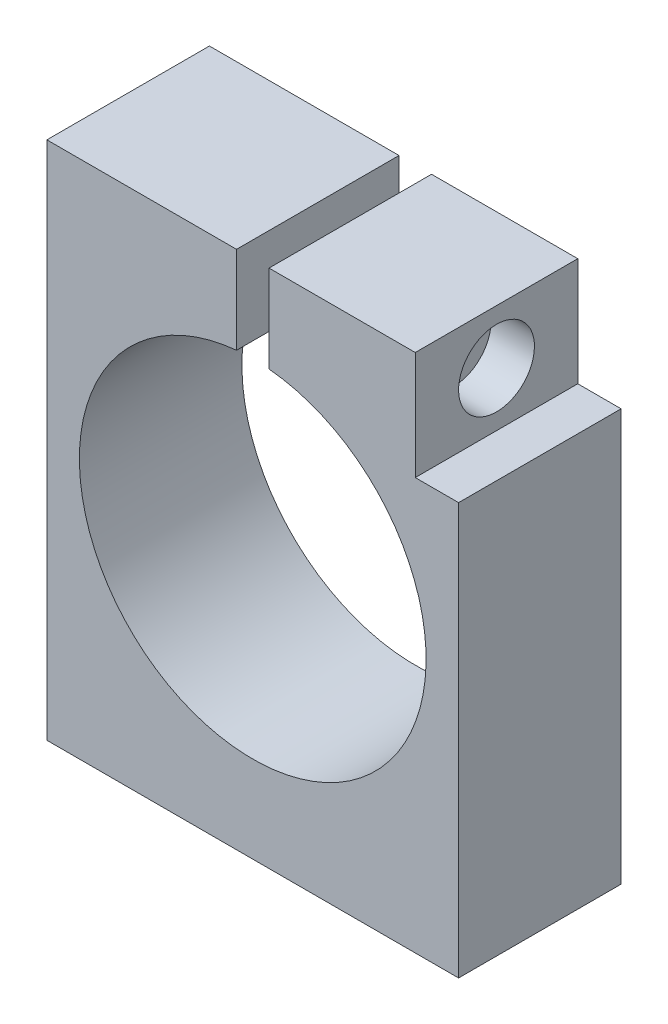
ISO-10303-21;
HEADER;
FILE_DESCRIPTION(('STEP AP214'),'2;1');
FILE_NAME('part.step','',(''),(''),'','','');
FILE_SCHEMA(('AUTOMOTIVE_DESIGN { 1 0 10303 214 1 1 1 1 }'));
ENDSEC;
DATA;
#1=APPLICATION_CONTEXT('core data for automotive mechanical design processes');
#2=APPLICATION_PROTOCOL_DEFINITION('international standard','automotive_design',2000,#1);
#3=PRODUCT_CONTEXT('',#1,'mechanical');
#4=PRODUCT('Part','Part','',(#3));
#5=PRODUCT_RELATED_PRODUCT_CATEGORY('part','',(#4));
#6=PRODUCT_DEFINITION_FORMATION('','',#4);
#7=PRODUCT_DEFINITION_CONTEXT('part definition',#1,'design');
#8=PRODUCT_DEFINITION('design','',#6,#7);
#9=PRODUCT_DEFINITION_SHAPE('','',#8);
#10=(LENGTH_UNIT() NAMED_UNIT(*) SI_UNIT(.MILLI.,.METRE.));
#11=(NAMED_UNIT(*) PLANE_ANGLE_UNIT() SI_UNIT($,.RADIAN.));
#12=(NAMED_UNIT(*) SI_UNIT($,.STERADIAN.) SOLID_ANGLE_UNIT());
#13=UNCERTAINTY_MEASURE_WITH_UNIT(LENGTH_MEASURE(1.E-05),#10,'distance_accuracy_value','');
#14=(GEOMETRIC_REPRESENTATION_CONTEXT(3) GLOBAL_UNCERTAINTY_ASSIGNED_CONTEXT((#13)) GLOBAL_UNIT_ASSIGNED_CONTEXT((#10,
#11,#12)) REPRESENTATION_CONTEXT('',''));
#15=CARTESIAN_POINT('',(0.,0.,0.));
#16=DIRECTION('',(0.,0.,1.));
#17=DIRECTION('',(1.,0.,0.));
#18=AXIS2_PLACEMENT_3D('',#15,#16,#17);
#19=CARTESIAN_POINT('',(-6.85746695095947,-4.99999999999999,15.));
#20=DIRECTION('',(0.,0.,-1.));
#21=DIRECTION('',(-1.,0.,0.));
#22=AXIS2_PLACEMENT_3D('',#19,#20,#21);
#23=CYLINDRICAL_SURFACE('',#22,16.);
#24=CARTESIAN_POINT('',(-6.85746695095947,-4.99999999999999,0.));
#25=DIRECTION('',(0.,0.,1.));
#26=DIRECTION('',(1.,0.,0.));
#27=AXIS2_PLACEMENT_3D('',#24,#25,#26);
#28=CIRCLE('',#27,16.);
#29=CARTESIAN_POINT('',(-8.35433092899201,10.9298273132909,0.));
#30=VERTEX_POINT('',#29);
#31=CARTESIAN_POINT('',(-5.35433092899201,10.929236707999,0.));
#32=VERTEX_POINT('',#31);
#33=EDGE_CURVE('E160',#30,#32,#28,.T.);
#34=ORIENTED_EDGE('',*,*,#33,.F.);
#35=DIRECTION('',(0.,0.,-1.));
#36=VECTOR('',#35,1.);
#37=CARTESIAN_POINT('',(-8.35433092899201,10.9298273132909,15.));
#38=LINE('',#37,#36);
#39=CARTESIAN_POINT('',(-8.35433092899201,10.9298273132909,15.));
#40=VERTEX_POINT('',#39);
#41=EDGE_CURVE('E11',#40,#30,#38,.T.);
#42=ORIENTED_EDGE('',*,*,#41,.F.);
#43=CARTESIAN_POINT('',(-6.85746695095947,-4.99999999999999,15.));
#44=DIRECTION('',(0.,0.,1.));
#45=DIRECTION('',(1.,0.,0.));
#46=AXIS2_PLACEMENT_3D('',#43,#44,#45);
#47=CIRCLE('',#46,16.);
#48=CARTESIAN_POINT('',(-5.35433092899201,10.929236707999,15.));
#49=VERTEX_POINT('',#48);
#50=EDGE_CURVE('E147',#40,#49,#47,.T.);
#51=ORIENTED_EDGE('',*,*,#50,.T.);
#52=DIRECTION('',(0.,0.,-1.));
#53=VECTOR('',#52,1.);
#54=CARTESIAN_POINT('',(-5.35433092899201,10.929236707999,15.));
#55=LINE('',#54,#53);
#56=EDGE_CURVE('E90',#49,#32,#55,.T.);
#57=ORIENTED_EDGE('',*,*,#56,.T.);
#58=EDGE_LOOP('',(#34,#42,#51,#57));
#59=FACE_BOUND('',#58,.T.);
#60=ADVANCED_FACE('F34',(#59),#23,.F.);
#61=CARTESIAN_POINT('',(-8.35433092899201,0.,15.));
#62=DIRECTION('',(1.,0.,0.));
#63=DIRECTION('',(0.,1.,0.));
#64=AXIS2_PLACEMENT_3D('',#61,#62,#63);
#65=PLANE('',#64);
#66=CARTESIAN_POINT('',(-8.35433092899201,14.,7.5));
#67=DIRECTION('',(1.,0.,0.));
#68=DIRECTION('',(0.,1.,0.));
#69=AXIS2_PLACEMENT_3D('',#66,#67,#68);
#70=CIRCLE('',#69,1.75);
#71=CARTESIAN_POINT('',(-8.35433092899201,15.75,7.5));
#72=VERTEX_POINT('',#71);
#73=EDGE_CURVE('E157',#72,#72,#70,.T.);
#74=ORIENTED_EDGE('',*,*,#73,.F.);
#75=EDGE_LOOP('',(#74));
#76=FACE_BOUND('',#75,.T.);
#77=DIRECTION('',(0.,-1.,0.));
#78=VECTOR('',#77,1.);
#79=CARTESIAN_POINT('',(-8.35433092899201,0.,0.));
#80=LINE('',#79,#78);
#81=CARTESIAN_POINT('',(-8.35433092899201,19.,0.));
#82=VERTEX_POINT('',#81);
#83=EDGE_CURVE('E198',#82,#30,#80,.T.);
#84=ORIENTED_EDGE('',*,*,#83,.F.);
#85=DIRECTION('',(0.,0.,-1.));
#86=VECTOR('',#85,1.);
#87=CARTESIAN_POINT('',(-8.35433092899201,19.,15.));
#88=LINE('',#87,#86);
#89=CARTESIAN_POINT('',(-8.35433092899201,19.,15.));
#90=VERTEX_POINT('',#89);
#91=EDGE_CURVE('E42',#90,#82,#88,.T.);
#92=ORIENTED_EDGE('',*,*,#91,.F.);
#93=DIRECTION('',(0.,-1.,0.));
#94=VECTOR('',#93,1.);
#95=CARTESIAN_POINT('',(-8.35433092899201,0.,15.));
#96=LINE('',#95,#94);
#97=EDGE_CURVE('E142',#90,#40,#96,.T.);
#98=ORIENTED_EDGE('',*,*,#97,.T.);
#99=ORIENTED_EDGE('',*,*,#41,.T.);
#100=EDGE_LOOP('',(#84,#92,#98,#99));
#101=FACE_BOUND('',#100,.T.);
#102=ADVANCED_FACE('F189',(#76,#101),#65,.T.);
#103=CARTESIAN_POINT('',(0.,19.,15.));
#104=DIRECTION('',(0.,1.,0.));
#105=DIRECTION('',(0.,0.,1.));
#106=AXIS2_PLACEMENT_3D('',#103,#104,#105);
#107=PLANE('',#106);
#108=DIRECTION('',(1.,0.,0.));
#109=VECTOR('',#108,1.);
#110=CARTESIAN_POINT('',(0.,19.,0.));
#111=LINE('',#110,#109);
#112=CARTESIAN_POINT('',(-25.8574669509595,19.,0.));
#113=VERTEX_POINT('',#112);
#114=EDGE_CURVE('E205',#113,#82,#111,.T.);
#115=ORIENTED_EDGE('',*,*,#114,.F.);
#116=DIRECTION('',(0.,0.,-1.));
#117=VECTOR('',#116,1.);
#118=CARTESIAN_POINT('',(-25.8574669509595,19.,15.));
#119=LINE('',#118,#117);
#120=CARTESIAN_POINT('',(-25.8574669509595,19.,15.));
#121=VERTEX_POINT('',#120);
#122=EDGE_CURVE('E233',#121,#113,#119,.T.);
#123=ORIENTED_EDGE('',*,*,#122,.F.);
#124=DIRECTION('',(1.,0.,0.));
#125=VECTOR('',#124,1.);
#126=CARTESIAN_POINT('',(0.,19.,15.));
#127=LINE('',#126,#125);
#128=EDGE_CURVE('E136',#121,#90,#127,.T.);
#129=ORIENTED_EDGE('',*,*,#128,.T.);
#130=ORIENTED_EDGE('',*,*,#91,.T.);
#131=EDGE_LOOP('',(#115,#123,#129,#130));
#132=FACE_BOUND('',#131,.T.);
#133=ADVANCED_FACE('F193',(#132),#107,.T.);
#134=CARTESIAN_POINT('',(-25.8574669509595,0.,15.));
#135=DIRECTION('',(1.,0.,0.));
#136=DIRECTION('',(0.,1.,0.));
#137=AXIS2_PLACEMENT_3D('',#134,#135,#136);
#138=PLANE('',#137);
#139=DIRECTION('',(0.,-1.,0.));
#140=VECTOR('',#139,1.);
#141=CARTESIAN_POINT('',(-25.8574669509595,0.,0.));
#142=LINE('',#141,#140);
#143=CARTESIAN_POINT('',(-25.8574669509595,-29.,0.));
#144=VERTEX_POINT('',#143);
#145=EDGE_CURVE('E207',#113,#144,#142,.T.);
#146=ORIENTED_EDGE('',*,*,#145,.T.);
#147=DIRECTION('',(0.,0.,-1.));
#148=VECTOR('',#147,1.);
#149=CARTESIAN_POINT('',(-25.8574669509595,-29.,15.));
#150=LINE('',#149,#148);
#151=CARTESIAN_POINT('',(-25.8574669509595,-29.,15.));
#152=VERTEX_POINT('',#151);
#153=EDGE_CURVE('E230',#152,#144,#150,.T.);
#154=ORIENTED_EDGE('',*,*,#153,.F.);
#155=DIRECTION('',(0.,-1.,0.));
#156=VECTOR('',#155,1.);
#157=CARTESIAN_POINT('',(-25.8574669509595,0.,15.));
#158=LINE('',#157,#156);
#159=EDGE_CURVE('E141',#121,#152,#158,.T.);
#160=ORIENTED_EDGE('',*,*,#159,.F.);
#161=ORIENTED_EDGE('',*,*,#122,.T.);
#162=EDGE_LOOP('',(#146,#154,#160,#161));
#163=FACE_BOUND('',#162,.T.);
#164=ADVANCED_FACE('F239',(#163),#138,.F.);
#165=CARTESIAN_POINT('',(0.,-29.,15.));
#166=DIRECTION('',(0.,1.,0.));
#167=DIRECTION('',(0.,0.,1.));
#168=AXIS2_PLACEMENT_3D('',#165,#166,#167);
#169=PLANE('',#168);
#170=DIRECTION('',(1.,0.,0.));
#171=VECTOR('',#170,1.);
#172=CARTESIAN_POINT('',(0.,-29.,0.));
#173=LINE('',#172,#171);
#174=CARTESIAN_POINT('',(12.1425330490405,-29.,0.));
#175=VERTEX_POINT('',#174);
#176=EDGE_CURVE('E212',#144,#175,#173,.T.);
#177=ORIENTED_EDGE('',*,*,#176,.T.);
#178=DIRECTION('',(0.,0.,-1.));
#179=VECTOR('',#178,1.);
#180=CARTESIAN_POINT('',(12.1425330490405,-29.,15.));
#181=LINE('',#180,#179);
#182=CARTESIAN_POINT('',(12.1425330490405,-29.,15.));
#183=VERTEX_POINT('',#182);
#184=EDGE_CURVE('E228',#183,#175,#181,.T.);
#185=ORIENTED_EDGE('',*,*,#184,.F.);
#186=DIRECTION('',(1.,0.,0.));
#187=VECTOR('',#186,1.);
#188=CARTESIAN_POINT('',(0.,-29.,15.));
#189=LINE('',#188,#187);
#190=EDGE_CURVE('E145',#152,#183,#189,.T.);
#191=ORIENTED_EDGE('',*,*,#190,.F.);
#192=ORIENTED_EDGE('',*,*,#153,.T.);
#193=EDGE_LOOP('',(#177,#185,#191,#192));
#194=FACE_BOUND('',#193,.T.);
#195=ADVANCED_FACE('F242',(#194),#169,.F.);
#196=CARTESIAN_POINT('',(12.1425330490405,0.,15.));
#197=DIRECTION('',(1.,0.,0.));
#198=DIRECTION('',(0.,1.,0.));
#199=AXIS2_PLACEMENT_3D('',#196,#197,#198);
#200=PLANE('',#199);
#201=DIRECTION('',(0.,-1.,0.));
#202=VECTOR('',#201,1.);
#203=CARTESIAN_POINT('',(12.1425330490405,0.,0.));
#204=LINE('',#203,#202);
#205=CARTESIAN_POINT('',(12.1425330490405,9.00000000000001,0.));
#206=VERTEX_POINT('',#205);
#207=EDGE_CURVE('E215',#206,#175,#204,.T.);
#208=ORIENTED_EDGE('',*,*,#207,.F.);
#209=DIRECTION('',(0.,0.,-1.));
#210=VECTOR('',#209,1.);
#211=CARTESIAN_POINT('',(12.1425330490405,9.00000000000001,15.));
#212=LINE('',#211,#210);
#213=CARTESIAN_POINT('',(12.1425330490405,9.00000000000001,15.));
#214=VERTEX_POINT('',#213);
#215=EDGE_CURVE('E226',#214,#206,#212,.T.);
#216=ORIENTED_EDGE('',*,*,#215,.F.);
#217=DIRECTION('',(0.,-1.,0.));
#218=VECTOR('',#217,1.);
#219=CARTESIAN_POINT('',(12.1425330490405,0.,15.));
#220=LINE('',#219,#218);
#221=EDGE_CURVE('E244',#214,#183,#220,.T.);
#222=ORIENTED_EDGE('',*,*,#221,.T.);
#223=ORIENTED_EDGE('',*,*,#184,.T.);
#224=EDGE_LOOP('',(#208,#216,#222,#223));
#225=FACE_BOUND('',#224,.T.);
#226=ADVANCED_FACE('F269',(#225),#200,.T.);
#227=CARTESIAN_POINT('',(0.,9.00000000000001,15.));
#228=DIRECTION('',(0.,1.,0.));
#229=DIRECTION('',(0.,0.,1.));
#230=AXIS2_PLACEMENT_3D('',#227,#228,#229);
#231=PLANE('',#230);
#232=DIRECTION('',(1.,0.,0.));
#233=VECTOR('',#232,1.);
#234=CARTESIAN_POINT('',(0.,9.00000000000001,0.));
#235=LINE('',#234,#233);
#236=CARTESIAN_POINT('',(8.14253304904053,9.00000000000001,0.));
#237=VERTEX_POINT('',#236);
#238=EDGE_CURVE('E218',#237,#206,#235,.T.);
#239=ORIENTED_EDGE('',*,*,#238,.F.);
#240=DIRECTION('',(0.,0.,-1.));
#241=VECTOR('',#240,1.);
#242=CARTESIAN_POINT('',(8.14253304904053,9.00000000000001,15.));
#243=LINE('',#242,#241);
#244=CARTESIAN_POINT('',(8.14253304904053,9.00000000000001,15.));
#245=VERTEX_POINT('',#244);
#246=EDGE_CURVE('E125',#245,#237,#243,.T.);
#247=ORIENTED_EDGE('',*,*,#246,.F.);
#248=DIRECTION('',(1.,0.,0.));
#249=VECTOR('',#248,1.);
#250=CARTESIAN_POINT('',(0.,9.00000000000001,15.));
#251=LINE('',#250,#249);
#252=EDGE_CURVE('E132',#245,#214,#251,.T.);
#253=ORIENTED_EDGE('',*,*,#252,.T.);
#254=ORIENTED_EDGE('',*,*,#215,.T.);
#255=EDGE_LOOP('',(#239,#247,#253,#254));
#256=FACE_BOUND('',#255,.T.);
#257=ADVANCED_FACE('F250',(#256),#231,.T.);
#258=CARTESIAN_POINT('',(8.14253304904053,0.,15.));
#259=DIRECTION('',(1.,0.,0.));
#260=DIRECTION('',(0.,1.,0.));
#261=AXIS2_PLACEMENT_3D('',#258,#259,#260);
#262=PLANE('',#261);
#263=CARTESIAN_POINT('',(8.14253304904053,14.,7.5));
#264=DIRECTION('',(1.,0.,0.));
#265=DIRECTION('',(0.,1.,0.));
#266=AXIS2_PLACEMENT_3D('',#263,#264,#265);
#267=CIRCLE('',#266,3.5);
#268=CARTESIAN_POINT('',(8.14253304904053,17.5,7.5));
#269=VERTEX_POINT('',#268);
#270=EDGE_CURVE('E153',#269,#269,#267,.T.);
#271=ORIENTED_EDGE('',*,*,#270,.F.);
#272=EDGE_LOOP('',(#271));
#273=FACE_BOUND('',#272,.T.);
#274=DIRECTION('',(0.,-1.,0.));
#275=VECTOR('',#274,1.);
#276=CARTESIAN_POINT('',(8.14253304904053,0.,0.));
#277=LINE('',#276,#275);
#278=CARTESIAN_POINT('',(8.14253304904053,19.,0.));
#279=VERTEX_POINT('',#278);
#280=EDGE_CURVE('E120',#279,#237,#277,.T.);
#281=ORIENTED_EDGE('',*,*,#280,.F.);
#282=DIRECTION('',(0.,0.,-1.));
#283=VECTOR('',#282,1.);
#284=CARTESIAN_POINT('',(8.14253304904053,19.,15.));
#285=LINE('',#284,#283);
#286=CARTESIAN_POINT('',(8.14253304904053,19.,15.));
#287=VERTEX_POINT('',#286);
#288=EDGE_CURVE('E115',#287,#279,#285,.T.);
#289=ORIENTED_EDGE('',*,*,#288,.F.);
#290=DIRECTION('',(0.,-1.,0.));
#291=VECTOR('',#290,1.);
#292=CARTESIAN_POINT('',(8.14253304904053,0.,15.));
#293=LINE('',#292,#291);
#294=EDGE_CURVE('E118',#287,#245,#293,.T.);
#295=ORIENTED_EDGE('',*,*,#294,.T.);
#296=ORIENTED_EDGE('',*,*,#246,.T.);
#297=EDGE_LOOP('',(#281,#289,#295,#296));
#298=FACE_BOUND('',#297,.T.);
#299=ADVANCED_FACE('F117',(#273,#298),#262,.T.);
#300=CARTESIAN_POINT('',(-5.35433092899201,19.,0.));
#301=VERTEX_POINT('',#300);
#302=EDGE_CURVE('E209',#301,#279,#111,.T.);
#303=ORIENTED_EDGE('',*,*,#302,.F.);
#304=DIRECTION('',(0.,0.,-1.));
#305=VECTOR('',#304,1.);
#306=CARTESIAN_POINT('',(-5.35433092899201,19.,15.));
#307=LINE('',#306,#305);
#308=CARTESIAN_POINT('',(-5.35433092899201,19.,15.));
#309=VERTEX_POINT('',#308);
#310=EDGE_CURVE('E83',#309,#301,#307,.T.);
#311=ORIENTED_EDGE('',*,*,#310,.F.);
#312=EDGE_CURVE('E129',#309,#287,#127,.T.);
#313=ORIENTED_EDGE('',*,*,#312,.T.);
#314=ORIENTED_EDGE('',*,*,#288,.T.);
#315=EDGE_LOOP('',(#303,#311,#313,#314));
#316=FACE_BOUND('',#315,.T.);
#317=ADVANCED_FACE('F134',(#316),#107,.T.);
#318=CARTESIAN_POINT('',(-5.35433092899201,0.,15.));
#319=DIRECTION('',(1.,0.,0.));
#320=DIRECTION('',(0.,0.,-1.));
#321=AXIS2_PLACEMENT_3D('',#318,#319,#320);
#322=PLANE('',#321);
#323=CARTESIAN_POINT('',(-5.35433092899201,14.,7.5));
#324=DIRECTION('',(1.,0.,0.));
#325=DIRECTION('',(0.,0.,-1.));
#326=AXIS2_PLACEMENT_3D('',#323,#324,#325);
#327=CIRCLE('',#326,1.75);
#328=CARTESIAN_POINT('',(-5.35433092899201,14.,5.75));
#329=VERTEX_POINT('',#328);
#330=EDGE_CURVE('E163',#329,#329,#327,.T.);
#331=ORIENTED_EDGE('',*,*,#330,.T.);
#332=EDGE_LOOP('',(#331));
#333=FACE_BOUND('',#332,.T.);
#334=DIRECTION('',(0.,-1.,0.));
#335=VECTOR('',#334,1.);
#336=CARTESIAN_POINT('',(-5.35433092899201,0.,0.));
#337=LINE('',#336,#335);
#338=EDGE_CURVE('E150',#301,#32,#337,.T.);
#339=ORIENTED_EDGE('',*,*,#338,.T.);
#340=ORIENTED_EDGE('',*,*,#56,.F.);
#341=DIRECTION('',(0.,-1.,0.));
#342=VECTOR('',#341,1.);
#343=CARTESIAN_POINT('',(-5.35433092899201,0.,15.));
#344=LINE('',#343,#342);
#345=EDGE_CURVE('E50',#309,#49,#344,.T.);
#346=ORIENTED_EDGE('',*,*,#345,.F.);
#347=ORIENTED_EDGE('',*,*,#310,.T.);
#348=EDGE_LOOP('',(#339,#340,#346,#347));
#349=FACE_BOUND('',#348,.T.);
#350=ADVANCED_FACE('F252',(#333,#349),#322,.F.);
#351=CARTESIAN_POINT('',(0.,0.,15.));
#352=DIRECTION('',(0.,0.,1.));
#353=DIRECTION('',(1.,0.,0.));
#354=AXIS2_PLACEMENT_3D('',#351,#352,#353);
#355=PLANE('',#354);
#356=ORIENTED_EDGE('',*,*,#50,.F.);
#357=ORIENTED_EDGE('',*,*,#97,.F.);
#358=ORIENTED_EDGE('',*,*,#128,.F.);
#359=ORIENTED_EDGE('',*,*,#159,.T.);
#360=ORIENTED_EDGE('',*,*,#190,.T.);
#361=ORIENTED_EDGE('',*,*,#221,.F.);
#362=ORIENTED_EDGE('',*,*,#252,.F.);
#363=ORIENTED_EDGE('',*,*,#294,.F.);
#364=ORIENTED_EDGE('',*,*,#312,.F.);
#365=ORIENTED_EDGE('',*,*,#345,.T.);
#366=EDGE_LOOP('',(#356,#357,#358,#359,#360,#361,#362,#363,#364,#365));
#367=FACE_BOUND('',#366,.T.);
#368=ADVANCED_FACE('F128',(#367),#355,.T.);
#369=CARTESIAN_POINT('',(0.,0.,0.));
#370=DIRECTION('',(0.,0.,1.));
#371=DIRECTION('',(1.,0.,0.));
#372=AXIS2_PLACEMENT_3D('',#369,#370,#371);
#373=PLANE('',#372);
#374=ORIENTED_EDGE('',*,*,#33,.T.);
#375=ORIENTED_EDGE('',*,*,#338,.F.);
#376=ORIENTED_EDGE('',*,*,#302,.T.);
#377=ORIENTED_EDGE('',*,*,#280,.T.);
#378=ORIENTED_EDGE('',*,*,#238,.T.);
#379=ORIENTED_EDGE('',*,*,#207,.T.);
#380=ORIENTED_EDGE('',*,*,#176,.F.);
#381=ORIENTED_EDGE('',*,*,#145,.F.);
#382=ORIENTED_EDGE('',*,*,#114,.T.);
#383=ORIENTED_EDGE('',*,*,#83,.T.);
#384=EDGE_LOOP('',(#374,#375,#376,#377,#378,#379,#380,#381,#382,#383));
#385=FACE_BOUND('',#384,.T.);
#386=ADVANCED_FACE('F202',(#385),#373,.F.);
#387=CARTESIAN_POINT('',(4.14253304904054,14.,7.5));
#388=DIRECTION('',(1.,0.,0.));
#389=DIRECTION('',(0.,1.,0.));
#390=AXIS2_PLACEMENT_3D('',#387,#388,#389);
#391=CYLINDRICAL_SURFACE('',#390,3.5);
#392=CARTESIAN_POINT('',(4.14253304904054,14.,7.5));
#393=DIRECTION('',(1.,0.,0.));
#394=DIRECTION('',(0.,1.,0.));
#395=AXIS2_PLACEMENT_3D('',#392,#393,#394);
#396=CIRCLE('',#395,3.5);
#397=CARTESIAN_POINT('',(4.14253304904054,17.5,7.5));
#398=VERTEX_POINT('',#397);
#399=EDGE_CURVE('E156',#398,#398,#396,.T.);
#400=ORIENTED_EDGE('',*,*,#399,.F.);
#401=EDGE_LOOP('',(#400));
#402=FACE_BOUND('',#401,.T.);
#403=ORIENTED_EDGE('',*,*,#270,.T.);
#404=EDGE_LOOP('',(#403));
#405=FACE_BOUND('',#404,.T.);
#406=ADVANCED_FACE('F291',(#402,#405),#391,.F.);
#407=CARTESIAN_POINT('',(4.14253304904054,14.,7.5));
#408=DIRECTION('',(1.,0.,0.));
#409=DIRECTION('',(0.,1.,0.));
#410=AXIS2_PLACEMENT_3D('',#407,#408,#409);
#411=PLANE('',#410);
#412=CARTESIAN_POINT('',(4.14253304904054,14.,7.5));
#413=DIRECTION('',(1.,0.,0.));
#414=DIRECTION('',(0.,1.,0.));
#415=AXIS2_PLACEMENT_3D('',#412,#413,#414);
#416=CIRCLE('',#415,1.75);
#417=CARTESIAN_POINT('',(4.14253304904054,15.75,7.5));
#418=VERTEX_POINT('',#417);
#419=EDGE_CURVE('E167',#418,#418,#416,.T.);
#420=ORIENTED_EDGE('',*,*,#419,.F.);
#421=EDGE_LOOP('',(#420));
#422=FACE_BOUND('',#421,.T.);
#423=ORIENTED_EDGE('',*,*,#399,.T.);
#424=EDGE_LOOP('',(#423));
#425=FACE_BOUND('',#424,.T.);
#426=ADVANCED_FACE('F185',(#422,#425),#411,.T.);
#427=CARTESIAN_POINT('',(-15.8574669509595,14.,7.5));
#428=DIRECTION('',(1.,0.,0.));
#429=DIRECTION('',(0.,1.,0.));
#430=AXIS2_PLACEMENT_3D('',#427,#428,#429);
#431=CYLINDRICAL_SURFACE('',#430,1.75);
#432=ORIENTED_EDGE('',*,*,#419,.T.);
#433=EDGE_LOOP('',(#432));
#434=FACE_BOUND('',#433,.T.);
#435=ORIENTED_EDGE('',*,*,#330,.F.);
#436=EDGE_LOOP('',(#435));
#437=FACE_BOUND('',#436,.T.);
#438=ADVANCED_FACE('F177',(#434,#437),#431,.F.);
#439=ORIENTED_EDGE('',*,*,#73,.T.);
#440=EDGE_LOOP('',(#439));
#441=FACE_BOUND('',#440,.T.);
#442=CARTESIAN_POINT('',(-15.8574669509595,14.,7.5));
#443=DIRECTION('',(1.,0.,0.));
#444=DIRECTION('',(0.,1.,0.));
#445=AXIS2_PLACEMENT_3D('',#442,#443,#444);
#446=CIRCLE('',#445,1.75);
#447=CARTESIAN_POINT('',(-15.8574669509595,15.75,7.5));
#448=VERTEX_POINT('',#447);
#449=EDGE_CURVE('E166',#448,#448,#446,.T.);
#450=ORIENTED_EDGE('',*,*,#449,.F.);
#451=EDGE_LOOP('',(#450));
#452=FACE_BOUND('',#451,.T.);
#453=ADVANCED_FACE('F175',(#441,#452),#431,.F.);
#454=CARTESIAN_POINT('',(-15.8574669509595,14.,7.5));
#455=DIRECTION('',(1.,0.,0.));
#456=DIRECTION('',(0.,1.,0.));
#457=AXIS2_PLACEMENT_3D('',#454,#455,#456);
#458=PLANE('',#457);
#459=ORIENTED_EDGE('',*,*,#449,.T.);
#460=EDGE_LOOP('',(#459));
#461=FACE_BOUND('',#460,.T.);
#462=ADVANCED_FACE('F173',(#461),#458,.T.);
#463=CLOSED_SHELL('',(#60,#102,#133,#164,#195,#226,#257,#299,#317,#350,#368,#386,#406,#426,#438,
#453,#462));
#464=MANIFOLD_SOLID_BREP('B2',#463);
#465=ADVANCED_BREP_SHAPE_REPRESENTATION('',(#18,#464),#14);
#466=SHAPE_DEFINITION_REPRESENTATION(#9,#465);
ENDSEC;
END-ISO-10303-21;
